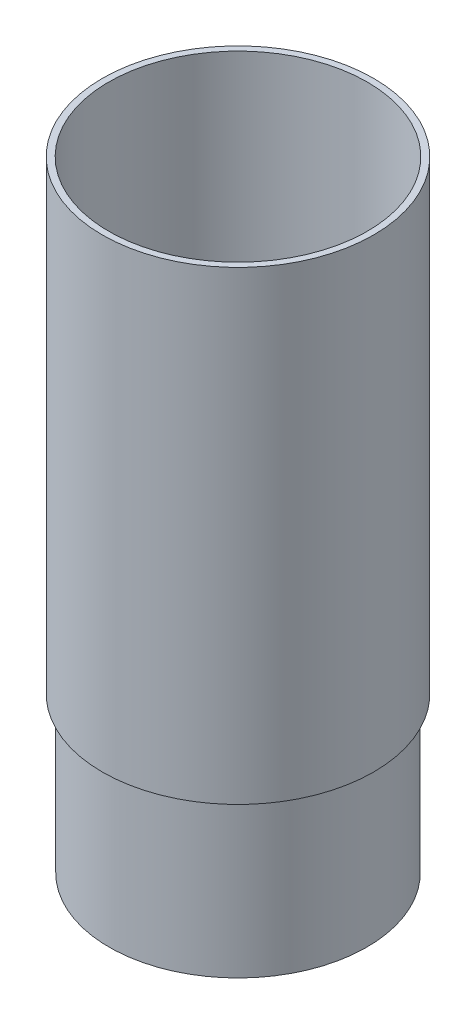
ISO-10303-21;
HEADER;
FILE_DESCRIPTION(('STEP AP214'),'2;1');
FILE_NAME('part.step','',(''),(''),'','','');
FILE_SCHEMA(('AUTOMOTIVE_DESIGN { 1 0 10303 214 1 1 1 1 }'));
ENDSEC;
DATA;
#1=APPLICATION_CONTEXT('core data for automotive mechanical design processes');
#2=APPLICATION_PROTOCOL_DEFINITION('international standard','automotive_design',2000,#1);
#3=PRODUCT_CONTEXT('',#1,'mechanical');
#4=PRODUCT('Part','Part','',(#3));
#5=PRODUCT_RELATED_PRODUCT_CATEGORY('part','',(#4));
#6=PRODUCT_DEFINITION_FORMATION('','',#4);
#7=PRODUCT_DEFINITION_CONTEXT('part definition',#1,'design');
#8=PRODUCT_DEFINITION('design','',#6,#7);
#9=PRODUCT_DEFINITION_SHAPE('','',#8);
#10=(LENGTH_UNIT() NAMED_UNIT(*) SI_UNIT(.MILLI.,.METRE.));
#11=(NAMED_UNIT(*) PLANE_ANGLE_UNIT() SI_UNIT($,.RADIAN.));
#12=(NAMED_UNIT(*) SI_UNIT($,.STERADIAN.) SOLID_ANGLE_UNIT());
#13=UNCERTAINTY_MEASURE_WITH_UNIT(LENGTH_MEASURE(1.E-05),#10,'distance_accuracy_value','');
#14=(GEOMETRIC_REPRESENTATION_CONTEXT(3) GLOBAL_UNCERTAINTY_ASSIGNED_CONTEXT((#13)) GLOBAL_UNIT_ASSIGNED_CONTEXT((#10,
#11,#12)) REPRESENTATION_CONTEXT('',''));
#15=CARTESIAN_POINT('',(0.,0.,0.));
#16=DIRECTION('',(0.,0.,1.));
#17=DIRECTION('',(1.,0.,0.));
#18=AXIS2_PLACEMENT_3D('',#15,#16,#17);
#19=CARTESIAN_POINT('',(21.1201,0.,1.47480870049002E-13));
#20=DIRECTION('',(0.,1.,0.));
#21=DIRECTION('',(0.,0.,1.));
#22=AXIS2_PLACEMENT_3D('',#19,#20,#21);
#23=PLANE('',#22);
#24=CARTESIAN_POINT('',(0.,0.,0.));
#25=DIRECTION('',(0.,-1.,0.));
#26=DIRECTION('',(0.,0.,-1.));
#27=AXIS2_PLACEMENT_3D('',#24,#25,#26);
#28=CIRCLE('',#27,20.0787);
#29=CARTESIAN_POINT('',(0.,0.,-20.0787));
#30=VERTEX_POINT('',#29);
#31=EDGE_CURVE('E10',#30,#30,#28,.T.);
#32=ORIENTED_EDGE('',*,*,#31,.F.);
#33=EDGE_LOOP('',(#32));
#34=FACE_BOUND('',#33,.T.);
#35=CARTESIAN_POINT('',(0.,0.,0.));
#36=DIRECTION('',(0.,-1.,0.));
#37=DIRECTION('',(0.,0.,-1.));
#38=AXIS2_PLACEMENT_3D('',#35,#36,#37);
#39=CIRCLE('',#38,21.1201);
#40=CARTESIAN_POINT('',(0.,0.,-21.1201));
#41=VERTEX_POINT('',#40);
#42=EDGE_CURVE('E62',#41,#41,#39,.T.);
#43=ORIENTED_EDGE('',*,*,#42,.T.);
#44=EDGE_LOOP('',(#43));
#45=FACE_BOUND('',#44,.T.);
#46=ADVANCED_FACE('F34',(#34,#45),#23,.F.);
#47=CARTESIAN_POINT('',(0.,0.,0.));
#48=DIRECTION('',(0.,-1.,0.));
#49=DIRECTION('',(0.,0.,-1.));
#50=AXIS2_PLACEMENT_3D('',#47,#48,#49);
#51=CYLINDRICAL_SURFACE('',#50,20.0787);
#52=CARTESIAN_POINT('',(0.,27.3,0.));
#53=DIRECTION('',(0.,-1.,0.));
#54=DIRECTION('',(0.,0.,-1.));
#55=AXIS2_PLACEMENT_3D('',#52,#53,#54);
#56=CIRCLE('',#55,20.0787);
#57=CARTESIAN_POINT('',(0.,27.3,-20.0787));
#58=VERTEX_POINT('',#57);
#59=EDGE_CURVE('E40',#58,#58,#56,.T.);
#60=ORIENTED_EDGE('',*,*,#59,.F.);
#61=EDGE_LOOP('',(#60));
#62=FACE_BOUND('',#61,.T.);
#63=ORIENTED_EDGE('',*,*,#31,.T.);
#64=EDGE_LOOP('',(#63));
#65=FACE_BOUND('',#64,.T.);
#66=ADVANCED_FACE('F99',(#62,#65),#51,.F.);
#67=CARTESIAN_POINT('',(0.,27.3,0.));
#68=DIRECTION('',(0.,1.,0.));
#69=DIRECTION('',(0.,0.,1.));
#70=AXIS2_PLACEMENT_3D('',#67,#68,#69);
#71=CONICAL_SURFACE('',#70,20.0787,0.261799387799149);
#72=CARTESIAN_POINT('',(0.,31.4235429372828,0.));
#73=DIRECTION('',(0.,-1.,0.));
#74=DIRECTION('',(0.,0.,-1.));
#75=AXIS2_PLACEMENT_3D('',#72,#73,#74);
#76=CIRCLE('',#75,21.1836);
#77=CARTESIAN_POINT('',(0.,31.4235429372828,-21.1836));
#78=VERTEX_POINT('',#77);
#79=EDGE_CURVE('E44',#78,#78,#76,.T.);
#80=ORIENTED_EDGE('',*,*,#79,.F.);
#81=EDGE_LOOP('',(#80));
#82=FACE_BOUND('',#81,.T.);
#83=ORIENTED_EDGE('',*,*,#59,.T.);
#84=EDGE_LOOP('',(#83));
#85=FACE_BOUND('',#84,.T.);
#86=ADVANCED_FACE('F94',(#82,#85),#71,.F.);
#87=CARTESIAN_POINT('',(0.,0.,0.));
#88=DIRECTION('',(0.,-1.,0.));
#89=DIRECTION('',(0.,0.,-1.));
#90=AXIS2_PLACEMENT_3D('',#87,#88,#89);
#91=CYLINDRICAL_SURFACE('',#90,21.1836);
#92=CARTESIAN_POINT('',(0.,101.6,0.));
#93=DIRECTION('',(0.,-1.,0.));
#94=DIRECTION('',(0.,0.,-1.));
#95=AXIS2_PLACEMENT_3D('',#92,#93,#94);
#96=CIRCLE('',#95,21.1836);
#97=CARTESIAN_POINT('',(0.,101.6,-21.1836));
#98=VERTEX_POINT('',#97);
#99=EDGE_CURVE('E48',#98,#98,#96,.T.);
#100=ORIENTED_EDGE('',*,*,#99,.F.);
#101=EDGE_LOOP('',(#100));
#102=FACE_BOUND('',#101,.T.);
#103=ORIENTED_EDGE('',*,*,#79,.T.);
#104=EDGE_LOOP('',(#103));
#105=FACE_BOUND('',#104,.T.);
#106=ADVANCED_FACE('F88',(#102,#105),#91,.F.);
#107=CARTESIAN_POINT('',(21.1836,101.6,1.47924288179035E-13));
#108=DIRECTION('',(0.,-1.,0.));
#109=DIRECTION('',(0.,0.,-1.));
#110=AXIS2_PLACEMENT_3D('',#107,#108,#109);
#111=PLANE('',#110);
#112=CARTESIAN_POINT('',(0.,101.6,0.));
#113=DIRECTION('',(0.,-1.,0.));
#114=DIRECTION('',(0.,0.,-1.));
#115=AXIS2_PLACEMENT_3D('',#112,#113,#114);
#116=CIRCLE('',#115,22.225);
#117=CARTESIAN_POINT('',(0.,101.6,-22.225));
#118=VERTEX_POINT('',#117);
#119=EDGE_CURVE('E53',#118,#118,#116,.T.);
#120=ORIENTED_EDGE('',*,*,#119,.F.);
#121=EDGE_LOOP('',(#120));
#122=FACE_BOUND('',#121,.T.);
#123=ORIENTED_EDGE('',*,*,#99,.T.);
#124=EDGE_LOOP('',(#123));
#125=FACE_BOUND('',#124,.T.);
#126=ADVANCED_FACE('F82',(#122,#125),#111,.F.);
#127=CARTESIAN_POINT('',(0.,0.,0.));
#128=DIRECTION('',(0.,-1.,0.));
#129=DIRECTION('',(0.,0.,-1.));
#130=AXIS2_PLACEMENT_3D('',#127,#128,#129);
#131=CYLINDRICAL_SURFACE('',#130,22.225);
#132=CARTESIAN_POINT('',(0.,25.4,0.));
#133=DIRECTION('',(0.,-1.,0.));
#134=DIRECTION('',(0.,0.,-1.));
#135=AXIS2_PLACEMENT_3D('',#132,#133,#134);
#136=CIRCLE('',#135,22.225);
#137=CARTESIAN_POINT('',(0.,25.4,-22.225));
#138=VERTEX_POINT('',#137);
#139=EDGE_CURVE('E56',#138,#138,#136,.T.);
#140=ORIENTED_EDGE('',*,*,#139,.F.);
#141=EDGE_LOOP('',(#140));
#142=FACE_BOUND('',#141,.T.);
#143=ORIENTED_EDGE('',*,*,#119,.T.);
#144=EDGE_LOOP('',(#143));
#145=FACE_BOUND('',#144,.T.);
#146=ADVANCED_FACE('F76',(#142,#145),#131,.T.);
#147=CARTESIAN_POINT('',(22.225,25.4,1.55196345511577E-13));
#148=DIRECTION('',(0.,1.,0.));
#149=DIRECTION('',(0.,0.,1.));
#150=AXIS2_PLACEMENT_3D('',#147,#148,#149);
#151=PLANE('',#150);
#152=CARTESIAN_POINT('',(0.,25.4,0.));
#153=DIRECTION('',(0.,-1.,0.));
#154=DIRECTION('',(0.,0.,-1.));
#155=AXIS2_PLACEMENT_3D('',#152,#153,#154);
#156=CIRCLE('',#155,21.1201);
#157=CARTESIAN_POINT('',(0.,25.4,-21.1201));
#158=VERTEX_POINT('',#157);
#159=EDGE_CURVE('E59',#158,#158,#156,.T.);
#160=ORIENTED_EDGE('',*,*,#159,.F.);
#161=EDGE_LOOP('',(#160));
#162=FACE_BOUND('',#161,.T.);
#163=ORIENTED_EDGE('',*,*,#139,.T.);
#164=EDGE_LOOP('',(#163));
#165=FACE_BOUND('',#164,.T.);
#166=ADVANCED_FACE('F70',(#162,#165),#151,.F.);
#167=CARTESIAN_POINT('',(0.,0.,0.));
#168=DIRECTION('',(0.,-1.,0.));
#169=DIRECTION('',(0.,0.,-1.));
#170=AXIS2_PLACEMENT_3D('',#167,#168,#169);
#171=CYLINDRICAL_SURFACE('',#170,21.1201);
#172=ORIENTED_EDGE('',*,*,#42,.F.);
#173=EDGE_LOOP('',(#172));
#174=FACE_BOUND('',#173,.T.);
#175=ORIENTED_EDGE('',*,*,#159,.T.);
#176=EDGE_LOOP('',(#175));
#177=FACE_BOUND('',#176,.T.);
#178=ADVANCED_FACE('F67',(#174,#177),#171,.T.);
#179=CLOSED_SHELL('',(#46,#66,#86,#106,#126,#146,#166,#178));
#180=MANIFOLD_SOLID_BREP('B2',#179);
#181=ADVANCED_BREP_SHAPE_REPRESENTATION('',(#18,#180),#14);
#182=SHAPE_DEFINITION_REPRESENTATION(#9,#181);
ENDSEC;
END-ISO-10303-21;
